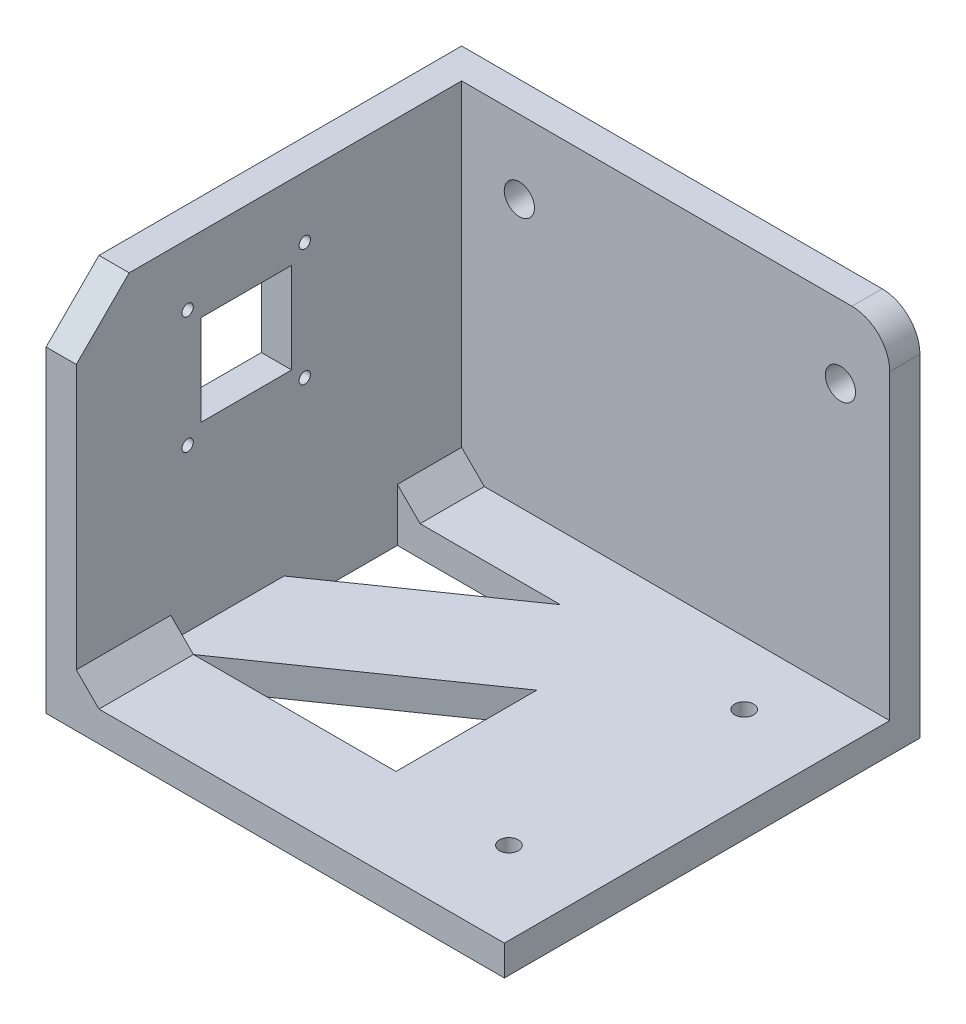
ISO-10303-21;
HEADER;
FILE_DESCRIPTION(('STEP AP214'),'2;1');
FILE_NAME('part.step','',(''),(''),'','','');
FILE_SCHEMA(('AUTOMOTIVE_DESIGN { 1 0 10303 214 1 1 1 1 }'));
ENDSEC;
DATA;
#1=APPLICATION_CONTEXT('core data for automotive mechanical design processes');
#2=APPLICATION_PROTOCOL_DEFINITION('international standard','automotive_design',2000,#1);
#3=PRODUCT_CONTEXT('',#1,'mechanical');
#4=PRODUCT('Part','Part','',(#3));
#5=PRODUCT_RELATED_PRODUCT_CATEGORY('part','',(#4));
#6=PRODUCT_DEFINITION_FORMATION('','',#4);
#7=PRODUCT_DEFINITION_CONTEXT('part definition',#1,'design');
#8=PRODUCT_DEFINITION('design','',#6,#7);
#9=PRODUCT_DEFINITION_SHAPE('','',#8);
#10=(LENGTH_UNIT() NAMED_UNIT(*) SI_UNIT(.MILLI.,.METRE.));
#11=(NAMED_UNIT(*) PLANE_ANGLE_UNIT() SI_UNIT($,.RADIAN.));
#12=(NAMED_UNIT(*) SI_UNIT($,.STERADIAN.) SOLID_ANGLE_UNIT());
#13=UNCERTAINTY_MEASURE_WITH_UNIT(LENGTH_MEASURE(1.E-05),#10,'distance_accuracy_value','');
#14=(GEOMETRIC_REPRESENTATION_CONTEXT(3) GLOBAL_UNCERTAINTY_ASSIGNED_CONTEXT((#13)) GLOBAL_UNIT_ASSIGNED_CONTEXT((#10,
#11,#12)) REPRESENTATION_CONTEXT('',''));
#15=CARTESIAN_POINT('',(0.,0.,0.));
#16=DIRECTION('',(0.,0.,1.));
#17=DIRECTION('',(1.,0.,0.));
#18=AXIS2_PLACEMENT_3D('',#15,#16,#17);
#19=CARTESIAN_POINT('',(92.6460575065019,47.983252299869,5.28762714402703));
#20=DIRECTION('',(0.,0.,-1.));
#21=DIRECTION('',(0.,1.,0.));
#22=AXIS2_PLACEMENT_3D('',#19,#20,#21);
#23=CYLINDRICAL_SURFACE('',#22,10.);
#24=DIRECTION('',(0.,0.,1.));
#25=VECTOR('',#24,1.);
#26=CARTESIAN_POINT('',(102.646057506502,47.983252299869,5.28762714402703));
#27=LINE('',#26,#25);
#28=CARTESIAN_POINT('',(102.646057506502,47.983252299869,-59.7123728559729));
#29=VERTEX_POINT('',#28);
#30=CARTESIAN_POINT('',(102.646057506502,47.983252299869,-51.712372855973));
#31=VERTEX_POINT('',#30);
#32=EDGE_CURVE('E337',#29,#31,#27,.T.);
#33=ORIENTED_EDGE('',*,*,#32,.F.);
#34=CARTESIAN_POINT('',(92.6460575065019,47.983252299869,-59.7123728559728));
#35=DIRECTION('',(0.,0.,1.));
#36=DIRECTION('',(0.,-1.,0.));
#37=AXIS2_PLACEMENT_3D('',#34,#35,#36);
#38=CIRCLE('',#37,10.);
#39=CARTESIAN_POINT('',(92.6460575065019,57.983252299869,-59.712372855973));
#40=VERTEX_POINT('',#39);
#41=EDGE_CURVE('E46',#40,#29,#38,.F.);
#42=ORIENTED_EDGE('',*,*,#41,.F.);
#43=DIRECTION('',(0.,0.,1.));
#44=VECTOR('',#43,1.);
#45=CARTESIAN_POINT('',(92.6460575065019,57.983252299869,5.28762714402703));
#46=LINE('',#45,#44);
#47=CARTESIAN_POINT('',(92.6460575065019,57.983252299869,-51.712372855973));
#48=VERTEX_POINT('',#47);
#49=EDGE_CURVE('E356',#48,#40,#46,.F.);
#50=ORIENTED_EDGE('',*,*,#49,.F.);
#51=CARTESIAN_POINT('',(92.6460575065019,47.983252299869,-51.712372855973));
#52=DIRECTION('',(0.,0.,1.));
#53=DIRECTION('',(1.,0.,0.));
#54=AXIS2_PLACEMENT_3D('',#51,#52,#53);
#55=CIRCLE('',#54,10.);
#56=EDGE_CURVE('E11',#31,#48,#55,.T.);
#57=ORIENTED_EDGE('',*,*,#56,.F.);
#58=EDGE_LOOP('',(#33,#42,#50,#57));
#59=FACE_BOUND('',#58,.T.);
#60=ADVANCED_FACE('F39',(#59),#23,.T.);
#61=CARTESIAN_POINT('',(-10.6622105369335,12.983252299869,5.28762714402702));
#62=DIRECTION('',(-1.,0.,0.));
#63=DIRECTION('',(0.,0.,1.));
#64=AXIS2_PLACEMENT_3D('',#61,#62,#63);
#65=PLANE('',#64);
#66=CARTESIAN_POINT('',(-10.6622105369335,10.7132522998699,20.8125171082051));
#67=DIRECTION('',(1.,0.,0.));
#68=DIRECTION('',(0.,0.,-1.));
#69=AXIS2_PLACEMENT_3D('',#66,#67,#68);
#70=CIRCLE('',#69,1.5);
#71=CARTESIAN_POINT('',(-10.6622105369335,10.7132522998699,19.3125171082051));
#72=VERTEX_POINT('',#71);
#73=EDGE_CURVE('E290',#72,#72,#70,.T.);
#74=ORIENTED_EDGE('',*,*,#73,.F.);
#75=EDGE_LOOP('',(#74));
#76=FACE_BOUND('',#75,.T.);
#77=CARTESIAN_POINT('',(-10.6622105369335,10.7132522998699,-10.1874828917949));
#78=DIRECTION('',(1.,0.,0.));
#79=DIRECTION('',(0.,0.,-1.));
#80=AXIS2_PLACEMENT_3D('',#77,#78,#79);
#81=CIRCLE('',#80,1.5);
#82=CARTESIAN_POINT('',(-10.6622105369335,10.7132522998699,-11.6874828917949));
#83=VERTEX_POINT('',#82);
#84=EDGE_CURVE('E287',#83,#83,#81,.T.);
#85=ORIENTED_EDGE('',*,*,#84,.F.);
#86=EDGE_LOOP('',(#85));
#87=FACE_BOUND('',#86,.T.);
#88=CARTESIAN_POINT('',(-10.6622105369335,41.7132522998699,-10.1874828917949));
#89=DIRECTION('',(1.,0.,0.));
#90=DIRECTION('',(0.,0.,-1.));
#91=AXIS2_PLACEMENT_3D('',#88,#89,#90);
#92=CIRCLE('',#91,1.5);
#93=CARTESIAN_POINT('',(-10.6622105369335,41.7132522998699,-11.6874828917949));
#94=VERTEX_POINT('',#93);
#95=EDGE_CURVE('E291',#94,#94,#92,.T.);
#96=ORIENTED_EDGE('',*,*,#95,.F.);
#97=EDGE_LOOP('',(#96));
#98=FACE_BOUND('',#97,.T.);
#99=CARTESIAN_POINT('',(-10.6622105369335,41.7132522998699,20.8125171082051));
#100=DIRECTION('',(1.,0.,0.));
#101=DIRECTION('',(0.,0.,-1.));
#102=AXIS2_PLACEMENT_3D('',#99,#100,#101);
#103=CIRCLE('',#102,1.5);
#104=CARTESIAN_POINT('',(-10.6622105369335,41.7132522998699,19.3125171082051));
#105=VERTEX_POINT('',#104);
#106=EDGE_CURVE('E280',#105,#105,#103,.T.);
#107=ORIENTED_EDGE('',*,*,#106,.F.);
#108=EDGE_LOOP('',(#107));
#109=FACE_BOUND('',#108,.T.);
#110=DIRECTION('',(0.,0.,-1.));
#111=VECTOR('',#110,1.);
#112=CARTESIAN_POINT('',(-10.6622105369335,14.213252299869,-6.71554840382064));
#113=LINE('',#112,#111);
#114=CARTESIAN_POINT('',(-10.6622105369335,14.213252299869,17.2844515961794));
#115=VERTEX_POINT('',#114);
#116=CARTESIAN_POINT('',(-10.6622105369335,14.213252299869,-6.71554840382064));
#117=VERTEX_POINT('',#116);
#118=EDGE_CURVE('E268',#115,#117,#113,.T.);
#119=ORIENTED_EDGE('',*,*,#118,.F.);
#120=DIRECTION('',(0.,-1.,0.));
#121=VECTOR('',#120,1.);
#122=CARTESIAN_POINT('',(-10.6622105369335,38.213252299869,17.2844515961794));
#123=LINE('',#122,#121);
#124=CARTESIAN_POINT('',(-10.6622105369335,38.213252299869,17.2844515961794));
#125=VERTEX_POINT('',#124);
#126=EDGE_CURVE('E266',#125,#115,#123,.T.);
#127=ORIENTED_EDGE('',*,*,#126,.F.);
#128=DIRECTION('',(0.,0.,1.));
#129=VECTOR('',#128,1.);
#130=CARTESIAN_POINT('',(-10.6622105369335,38.213252299869,-6.71554840382064));
#131=LINE('',#130,#129);
#132=CARTESIAN_POINT('',(-10.6622105369335,38.213252299869,-6.71554840382064));
#133=VERTEX_POINT('',#132);
#134=EDGE_CURVE('E274',#133,#125,#131,.T.);
#135=ORIENTED_EDGE('',*,*,#134,.F.);
#136=DIRECTION('',(0.,1.,0.));
#137=VECTOR('',#136,1.);
#138=CARTESIAN_POINT('',(-10.6622105369335,38.213252299869,-6.71554840382064));
#139=LINE('',#138,#137);
#140=EDGE_CURVE('E271',#117,#133,#139,.T.);
#141=ORIENTED_EDGE('',*,*,#140,.F.);
#142=EDGE_LOOP('',(#119,#127,#135,#141));
#143=FACE_BOUND('',#142,.T.);
#144=DIRECTION('',(0.,0.,1.));
#145=VECTOR('',#144,1.);
#146=CARTESIAN_POINT('',(-10.6622105369335,-26.016747700131,-59.712372855973));
#147=LINE('',#146,#145);
#148=CARTESIAN_POINT('',(-10.6622105369335,-26.016747700131,-51.712372855973));
#149=VERTEX_POINT('',#148);
#150=CARTESIAN_POINT('',(-10.6622105369335,-26.016747700131,-34.712372855973));
#151=VERTEX_POINT('',#150);
#152=EDGE_CURVE('E223',#149,#151,#147,.T.);
#153=ORIENTED_EDGE('',*,*,#152,.F.);
#154=DIRECTION('',(0.,1.,0.));
#155=VECTOR('',#154,1.);
#156=CARTESIAN_POINT('',(-10.6622105369335,12.983252299869,-51.712372855973));
#157=LINE('',#156,#155);
#158=CARTESIAN_POINT('',(-10.6622105369335,57.983252299869,-51.712372855973));
#159=VERTEX_POINT('',#158);
#160=EDGE_CURVE('E419',#149,#159,#157,.T.);
#161=ORIENTED_EDGE('',*,*,#160,.T.);
#162=DIRECTION('',(0.,0.,1.));
#163=VECTOR('',#162,1.);
#164=CARTESIAN_POINT('',(-10.6622105369335,57.983252299869,-39.712372855973));
#165=LINE('',#164,#163);
#166=CARTESIAN_POINT('',(-10.6622105369335,57.983252299869,36.287627144027));
#167=VERTEX_POINT('',#166);
#168=EDGE_CURVE('E302',#159,#167,#165,.T.);
#169=ORIENTED_EDGE('',*,*,#168,.T.);
#170=DIRECTION('',(0.,0.707106781186547,-0.707106781186547));
#171=VECTOR('',#170,1.);
#172=CARTESIAN_POINT('',(-10.6622105369335,43.983252299869,50.287627144027));
#173=LINE('',#172,#171);
#174=CARTESIAN_POINT('',(-10.6622105369335,43.983252299869,50.287627144027));
#175=VERTEX_POINT('',#174);
#176=EDGE_CURVE('E225',#175,#167,#173,.T.);
#177=ORIENTED_EDGE('',*,*,#176,.F.);
#178=DIRECTION('',(0.,-1.,0.));
#179=VECTOR('',#178,1.);
#180=CARTESIAN_POINT('',(-10.6622105369335,57.983252299869,50.287627144027));
#181=LINE('',#180,#179);
#182=CARTESIAN_POINT('',(-10.6622105369335,-26.016747700131,50.287627144027));
#183=VERTEX_POINT('',#182);
#184=EDGE_CURVE('E299',#175,#183,#181,.T.);
#185=ORIENTED_EDGE('',*,*,#184,.T.);
#186=CARTESIAN_POINT('',(-10.6622105369335,-26.016747700131,25.287627144027));
#187=VERTEX_POINT('',#186);
#188=EDGE_CURVE('E226',#187,#183,#147,.T.);
#189=ORIENTED_EDGE('',*,*,#188,.F.);
#190=DIRECTION('',(0.,-1.,0.));
#191=VECTOR('',#190,1.);
#192=CARTESIAN_POINT('',(-10.6622105369335,57.983252299869,25.287627144027));
#193=LINE('',#192,#191);
#194=CARTESIAN_POINT('',(-10.6622105369335,-32.016747700131,25.287627144027));
#195=VERTEX_POINT('',#194);
#196=EDGE_CURVE('E199',#187,#195,#193,.T.);
#197=ORIENTED_EDGE('',*,*,#196,.T.);
#198=DIRECTION('',(0.,0.,1.));
#199=VECTOR('',#198,1.);
#200=CARTESIAN_POINT('',(-10.6622105369335,-32.016747700131,-4.712372855973));
#201=LINE('',#200,#199);
#202=CARTESIAN_POINT('',(-10.6622105369335,-32.016747700131,-4.712372855973));
#203=VERTEX_POINT('',#202);
#204=EDGE_CURVE('E397',#203,#195,#201,.T.);
#205=ORIENTED_EDGE('',*,*,#204,.F.);
#206=DIRECTION('',(0.,-1.,0.));
#207=VECTOR('',#206,1.);
#208=CARTESIAN_POINT('',(-10.6622105369335,-32.016747700131,-4.712372855973));
#209=LINE('',#208,#207);
#210=CARTESIAN_POINT('',(-10.6622105369335,-40.016747700131,-4.71237285597299));
#211=VERTEX_POINT('',#210);
#212=EDGE_CURVE('E409',#203,#211,#209,.T.);
#213=ORIENTED_EDGE('',*,*,#212,.T.);
#214=DIRECTION('',(0.,0.,-1.));
#215=VECTOR('',#214,1.);
#216=CARTESIAN_POINT('',(-10.6622105369335,-40.016747700131,-34.712372855973));
#217=LINE('',#216,#215);
#218=CARTESIAN_POINT('',(-10.6622105369335,-40.016747700131,-34.712372855973));
#219=VERTEX_POINT('',#218);
#220=EDGE_CURVE('E427',#211,#219,#217,.T.);
#221=ORIENTED_EDGE('',*,*,#220,.T.);
#222=DIRECTION('',(0.,-1.,0.));
#223=VECTOR('',#222,1.);
#224=CARTESIAN_POINT('',(-10.6622105369335,57.983252299869,-34.712372855973));
#225=LINE('',#224,#223);
#226=EDGE_CURVE('E200',#151,#219,#225,.T.);
#227=ORIENTED_EDGE('',*,*,#226,.F.);
#228=EDGE_LOOP('',(#153,#161,#169,#177,#185,#189,#197,#205,#213,#221,#227));
#229=FACE_BOUND('',#228,.T.);
#230=ADVANCED_FACE('F384',(#76,#87,#98,#109,#143,#229),#65,.F.);
#231=CARTESIAN_POINT('',(48.9521140423729,57.983252299869,-34.712372855973));
#232=DIRECTION('',(1.,0.,0.));
#233=DIRECTION('',(0.,0.,-1.));
#234=AXIS2_PLACEMENT_3D('',#231,#232,#233);
#235=PLANE('',#234);
#236=DIRECTION('',(0.,-1.,0.));
#237=VECTOR('',#236,1.);
#238=CARTESIAN_POINT('',(48.9521140423729,-32.016747700131,-11.9915943580509));
#239=LINE('',#238,#237);
#240=CARTESIAN_POINT('',(48.9521140423729,-32.016747700131,-11.9915943580509));
#241=VERTEX_POINT('',#240);
#242=CARTESIAN_POINT('',(48.9521140423729,-40.016747700131,-11.9915943580509));
#243=VERTEX_POINT('',#242);
#244=EDGE_CURVE('E186',#241,#243,#239,.T.);
#245=ORIENTED_EDGE('',*,*,#244,.T.);
#246=DIRECTION('',(0.,0.,1.));
#247=VECTOR('',#246,1.);
#248=CARTESIAN_POINT('',(48.9521140423729,-40.016747700131,-34.712372855973));
#249=LINE('',#248,#247);
#250=CARTESIAN_POINT('',(48.9521140423729,-40.016747700131,25.287627144027));
#251=VERTEX_POINT('',#250);
#252=EDGE_CURVE('E181',#243,#251,#249,.T.);
#253=ORIENTED_EDGE('',*,*,#252,.T.);
#254=DIRECTION('',(0.,-1.,0.));
#255=VECTOR('',#254,1.);
#256=CARTESIAN_POINT('',(48.9521140423729,57.983252299869,25.287627144027));
#257=LINE('',#256,#255);
#258=CARTESIAN_POINT('',(48.9521140423729,-32.016747700131,25.287627144027));
#259=VERTEX_POINT('',#258);
#260=EDGE_CURVE('E184',#259,#251,#257,.T.);
#261=ORIENTED_EDGE('',*,*,#260,.F.);
#262=DIRECTION('',(0.,0.,1.));
#263=VECTOR('',#262,1.);
#264=CARTESIAN_POINT('',(48.9521140423729,-32.016747700131,50.287627144027));
#265=LINE('',#264,#263);
#266=EDGE_CURVE('E217',#241,#259,#265,.T.);
#267=ORIENTED_EDGE('',*,*,#266,.F.);
#268=EDGE_LOOP('',(#245,#253,#261,#267));
#269=FACE_BOUND('',#268,.T.);
#270=ADVANCED_FACE('F183',(#269),#235,.F.);
#271=CARTESIAN_POINT('',(-10.6622105369335,57.983252299869,25.287627144027));
#272=DIRECTION('',(0.,0.,1.));
#273=DIRECTION('',(1.,0.,0.));
#274=AXIS2_PLACEMENT_3D('',#271,#272,#273);
#275=PLANE('',#274);
#276=DIRECTION('',(0.,-1.,0.));
#277=VECTOR('',#276,1.);
#278=CARTESIAN_POINT('',(-4.66221053693349,-32.016747700131,25.287627144027));
#279=LINE('',#278,#277);
#280=CARTESIAN_POINT('',(-4.66221053693349,-32.016747700131,25.287627144027));
#281=VERTEX_POINT('',#280);
#282=CARTESIAN_POINT('',(-4.66221053693349,-40.016747700131,25.287627144027));
#283=VERTEX_POINT('',#282);
#284=EDGE_CURVE('E425',#281,#283,#279,.T.);
#285=ORIENTED_EDGE('',*,*,#284,.F.);
#286=DIRECTION('',(-1.,0.,0.));
#287=VECTOR('',#286,1.);
#288=CARTESIAN_POINT('',(102.646057506502,-32.016747700131,25.287627144027));
#289=LINE('',#288,#287);
#290=EDGE_CURVE('E198',#259,#281,#289,.T.);
#291=ORIENTED_EDGE('',*,*,#290,.F.);
#292=ORIENTED_EDGE('',*,*,#260,.T.);
#293=DIRECTION('',(-1.,0.,0.));
#294=VECTOR('',#293,1.);
#295=CARTESIAN_POINT('',(-10.6622105369335,-40.016747700131,25.287627144027));
#296=LINE('',#295,#294);
#297=EDGE_CURVE('E191',#251,#283,#296,.T.);
#298=ORIENTED_EDGE('',*,*,#297,.T.);
#299=EDGE_LOOP('',(#285,#291,#292,#298));
#300=FACE_BOUND('',#299,.T.);
#301=ADVANCED_FACE('F196',(#300),#275,.F.);
#302=CARTESIAN_POINT('',(-10.6622105369335,57.983252299869,-34.712372855973));
#303=DIRECTION('',(0.,0.,-1.));
#304=DIRECTION('',(-1.,0.,0.));
#305=AXIS2_PLACEMENT_3D('',#302,#303,#304);
#306=PLANE('',#305);
#307=DIRECTION('',(0.,-1.,0.));
#308=VECTOR('',#307,1.);
#309=CARTESIAN_POINT('',(32.4832649470313,-32.016747700131,-34.712372855973));
#310=LINE('',#309,#308);
#311=CARTESIAN_POINT('',(32.4832649470313,-32.016747700131,-34.712372855973));
#312=VERTEX_POINT('',#311);
#313=CARTESIAN_POINT('',(32.4832649470313,-40.016747700131,-34.712372855973));
#314=VERTEX_POINT('',#313);
#315=EDGE_CURVE('E411',#312,#314,#310,.T.);
#316=ORIENTED_EDGE('',*,*,#315,.F.);
#317=DIRECTION('',(1.,0.,0.));
#318=VECTOR('',#317,1.);
#319=CARTESIAN_POINT('',(102.646057506502,-32.016747700131,-34.712372855973));
#320=LINE('',#319,#318);
#321=CARTESIAN_POINT('',(-4.66221053693349,-32.016747700131,-34.712372855973));
#322=VERTEX_POINT('',#321);
#323=EDGE_CURVE('E212',#322,#312,#320,.T.);
#324=ORIENTED_EDGE('',*,*,#323,.F.);
#325=DIRECTION('',(-0.707106781186547,0.707106781186548,0.));
#326=VECTOR('',#325,1.);
#327=CARTESIAN_POINT('',(-10.6622105369335,-26.016747700131,-34.712372855973));
#328=LINE('',#327,#326);
#329=EDGE_CURVE('E328',#322,#151,#328,.T.);
#330=ORIENTED_EDGE('',*,*,#329,.T.);
#331=ORIENTED_EDGE('',*,*,#226,.T.);
#332=DIRECTION('',(1.,0.,0.));
#333=VECTOR('',#332,1.);
#334=CARTESIAN_POINT('',(-10.6622105369335,-40.016747700131,-34.712372855973));
#335=LINE('',#334,#333);
#336=EDGE_CURVE('E192',#219,#314,#335,.T.);
#337=ORIENTED_EDGE('',*,*,#336,.T.);
#338=EDGE_LOOP('',(#316,#324,#330,#331,#337));
#339=FACE_BOUND('',#338,.T.);
#340=ADVANCED_FACE('F430',(#339),#306,.F.);
#341=CARTESIAN_POINT('',(-10.6622105369335,-26.016747700131,-59.712372855973));
#342=DIRECTION('',(0.707106781186548,0.707106781186547,0.));
#343=DIRECTION('',(-0.707106781186547,0.707106781186548,0.));
#344=AXIS2_PLACEMENT_3D('',#341,#342,#343);
#345=PLANE('',#344);
#346=DIRECTION('',(0.707106781186547,-0.707106781186548,0.));
#347=VECTOR('',#346,1.);
#348=CARTESIAN_POINT('',(-10.6622105369335,-26.016747700131,25.287627144027));
#349=LINE('',#348,#347);
#350=EDGE_CURVE('E331',#187,#281,#349,.T.);
#351=ORIENTED_EDGE('',*,*,#350,.F.);
#352=ORIENTED_EDGE('',*,*,#188,.T.);
#353=DIRECTION('',(-0.707106781186547,0.707106781186548,0.));
#354=VECTOR('',#353,1.);
#355=CARTESIAN_POINT('',(-10.6622105369335,-26.016747700131,50.287627144027));
#356=LINE('',#355,#354);
#357=CARTESIAN_POINT('',(-4.66221053693349,-32.016747700131,50.287627144027));
#358=VERTEX_POINT('',#357);
#359=EDGE_CURVE('E219',#358,#183,#356,.T.);
#360=ORIENTED_EDGE('',*,*,#359,.F.);
#361=DIRECTION('',(0.,0.,1.));
#362=VECTOR('',#361,1.);
#363=CARTESIAN_POINT('',(-4.66221053693349,-32.016747700131,-59.712372855973));
#364=LINE('',#363,#362);
#365=EDGE_CURVE('E222',#281,#358,#364,.T.);
#366=ORIENTED_EDGE('',*,*,#365,.F.);
#367=EDGE_LOOP('',(#351,#352,#360,#366));
#368=FACE_BOUND('',#367,.T.);
#369=ADVANCED_FACE('F394',(#368),#345,.T.);
#370=CARTESIAN_POINT('',(102.646057506502,-32.016747700131,50.287627144027));
#371=DIRECTION('',(0.,-1.,0.));
#372=DIRECTION('',(0.,0.,-1.));
#373=AXIS2_PLACEMENT_3D('',#370,#371,#372);
#374=PLANE('',#373);
#375=CARTESIAN_POINT('',(80.8237614787084,-32.016747700131,-35.0168591290556));
#376=DIRECTION('',(0.,1.,0.));
#377=DIRECTION('',(0.,0.,1.));
#378=AXIS2_PLACEMENT_3D('',#375,#376,#377);
#379=CIRCLE('',#378,2.5);
#380=CARTESIAN_POINT('',(80.8237614787084,-32.016747700131,-32.5168591290556));
#381=VERTEX_POINT('',#380);
#382=EDGE_CURVE('E346',#381,#381,#379,.T.);
#383=ORIENTED_EDGE('',*,*,#382,.F.);
#384=EDGE_LOOP('',(#383));
#385=FACE_BOUND('',#384,.T.);
#386=CARTESIAN_POINT('',(80.8237614787084,-32.016747700131,27.2596519715804));
#387=DIRECTION('',(0.,1.,0.));
#388=DIRECTION('',(0.,0.,1.));
#389=AXIS2_PLACEMENT_3D('',#386,#387,#388);
#390=CIRCLE('',#389,2.5);
#391=CARTESIAN_POINT('',(80.8237614787084,-32.016747700131,29.7596519715804));
#392=VERTEX_POINT('',#391);
#393=EDGE_CURVE('E342',#392,#392,#390,.T.);
#394=ORIENTED_EDGE('',*,*,#393,.F.);
#395=EDGE_LOOP('',(#394));
#396=FACE_BOUND('',#395,.T.);
#397=DIRECTION('',(0.,0.,1.));
#398=VECTOR('',#397,1.);
#399=CARTESIAN_POINT('',(102.646057506502,-32.016747700131,50.287627144027));
#400=LINE('',#399,#398);
#401=CARTESIAN_POINT('',(102.646057506502,-32.016747700131,-51.712372855973));
#402=VERTEX_POINT('',#401);
#403=CARTESIAN_POINT('',(102.646057506502,-32.016747700131,50.287627144027));
#404=VERTEX_POINT('',#403);
#405=EDGE_CURVE('E252',#402,#404,#400,.T.);
#406=ORIENTED_EDGE('',*,*,#405,.F.);
#407=DIRECTION('',(-1.,0.,0.));
#408=VECTOR('',#407,1.);
#409=CARTESIAN_POINT('',(102.646057506502,-32.016747700131,-51.712372855973));
#410=LINE('',#409,#408);
#411=CARTESIAN_POINT('',(-4.66221053693349,-32.016747700131,-51.712372855973));
#412=VERTEX_POINT('',#411);
#413=EDGE_CURVE('E443',#402,#412,#410,.T.);
#414=ORIENTED_EDGE('',*,*,#413,.T.);
#415=EDGE_CURVE('E227',#412,#322,#364,.T.);
#416=ORIENTED_EDGE('',*,*,#415,.T.);
#417=ORIENTED_EDGE('',*,*,#323,.T.);
#418=DIRECTION('',(-0.821032247487943,0.,0.570881816652884));
#419=VECTOR('',#418,1.);
#420=CARTESIAN_POINT('',(32.4832649470313,-32.016747700131,-34.712372855973));
#421=LINE('',#420,#419);
#422=EDGE_CURVE('E407',#312,#203,#421,.T.);
#423=ORIENTED_EDGE('',*,*,#422,.T.);
#424=ORIENTED_EDGE('',*,*,#204,.T.);
#425=DIRECTION('',(1.,0.,0.));
#426=VECTOR('',#425,1.);
#427=CARTESIAN_POINT('',(-10.6622105369335,-32.016747700131,25.287627144027));
#428=LINE('',#427,#426);
#429=EDGE_CURVE('E405',#195,#281,#428,.T.);
#430=ORIENTED_EDGE('',*,*,#429,.T.);
#431=DIRECTION('',(0.821032247487943,0.,-0.570881816652884));
#432=VECTOR('',#431,1.);
#433=CARTESIAN_POINT('',(-4.66221053693349,-32.016747700131,25.287627144027));
#434=LINE('',#433,#432);
#435=EDGE_CURVE('E413',#281,#241,#434,.T.);
#436=ORIENTED_EDGE('',*,*,#435,.T.);
#437=ORIENTED_EDGE('',*,*,#266,.T.);
#438=ORIENTED_EDGE('',*,*,#290,.T.);
#439=ORIENTED_EDGE('',*,*,#365,.T.);
#440=DIRECTION('',(-1.,0.,0.));
#441=VECTOR('',#440,1.);
#442=CARTESIAN_POINT('',(102.646057506502,-32.016747700131,50.287627144027));
#443=LINE('',#442,#441);
#444=EDGE_CURVE('E254',#404,#358,#443,.T.);
#445=ORIENTED_EDGE('',*,*,#444,.F.);
#446=EDGE_LOOP('',(#406,#414,#416,#417,#423,#424,#430,#436,#437,#438,#439,#445));
#447=FACE_BOUND('',#446,.T.);
#448=ADVANCED_FACE('F403',(#385,#396,#447),#374,.F.);
#449=CARTESIAN_POINT('',(-10.6622105369335,57.983252299869,-39.712372855973));
#450=DIRECTION('',(0.,-1.,0.));
#451=DIRECTION('',(0.,0.,-1.));
#452=AXIS2_PLACEMENT_3D('',#449,#450,#451);
#453=PLANE('',#452);
#454=DIRECTION('',(-1.,0.,0.));
#455=VECTOR('',#454,1.);
#456=CARTESIAN_POINT('',(-18.6622105369335,57.983252299869,-51.712372855973));
#457=LINE('',#456,#455);
#458=EDGE_CURVE('E341',#48,#159,#457,.T.);
#459=ORIENTED_EDGE('',*,*,#458,.F.);
#460=ORIENTED_EDGE('',*,*,#49,.T.);
#461=DIRECTION('',(1.,0.,0.));
#462=VECTOR('',#461,1.);
#463=CARTESIAN_POINT('',(-18.6622105369335,57.983252299869,-59.712372855973));
#464=LINE('',#463,#462);
#465=CARTESIAN_POINT('',(-18.6622105369335,57.983252299869,-59.712372855973));
#466=VERTEX_POINT('',#465);
#467=EDGE_CURVE('E237',#466,#40,#464,.T.);
#468=ORIENTED_EDGE('',*,*,#467,.F.);
#469=DIRECTION('',(0.,0.,1.));
#470=VECTOR('',#469,1.);
#471=CARTESIAN_POINT('',(-18.6622105369335,57.983252299869,-39.712372855973));
#472=LINE('',#471,#470);
#473=CARTESIAN_POINT('',(-18.6622105369335,57.983252299869,36.287627144027));
#474=VERTEX_POINT('',#473);
#475=EDGE_CURVE('E303',#466,#474,#472,.T.);
#476=ORIENTED_EDGE('',*,*,#475,.T.);
#477=DIRECTION('',(1.,0.,0.));
#478=VECTOR('',#477,1.);
#479=CARTESIAN_POINT('',(-18.6622105369335,57.983252299869,36.287627144027));
#480=LINE('',#479,#478);
#481=EDGE_CURVE('E232',#474,#167,#480,.T.);
#482=ORIENTED_EDGE('',*,*,#481,.T.);
#483=ORIENTED_EDGE('',*,*,#168,.F.);
#484=EDGE_LOOP('',(#459,#460,#468,#476,#482,#483));
#485=FACE_BOUND('',#484,.T.);
#486=ADVANCED_FACE('F375',(#485),#453,.F.);
#487=CARTESIAN_POINT('',(-10.6622105369335,57.983252299869,50.287627144027));
#488=DIRECTION('',(0.,0.,-1.));
#489=DIRECTION('',(0.,1.,0.));
#490=AXIS2_PLACEMENT_3D('',#487,#488,#489);
#491=PLANE('',#490);
#492=ORIENTED_EDGE('',*,*,#444,.T.);
#493=ORIENTED_EDGE('',*,*,#359,.T.);
#494=ORIENTED_EDGE('',*,*,#184,.F.);
#495=DIRECTION('',(1.,0.,0.));
#496=VECTOR('',#495,1.);
#497=CARTESIAN_POINT('',(-18.6622105369335,43.983252299869,50.287627144027));
#498=LINE('',#497,#496);
#499=CARTESIAN_POINT('',(-18.6622105369335,43.983252299869,50.287627144027));
#500=VERTEX_POINT('',#499);
#501=EDGE_CURVE('E235',#500,#175,#498,.T.);
#502=ORIENTED_EDGE('',*,*,#501,.F.);
#503=DIRECTION('',(0.,-1.,0.));
#504=VECTOR('',#503,1.);
#505=CARTESIAN_POINT('',(-18.6622105369335,57.983252299869,50.287627144027));
#506=LINE('',#505,#504);
#507=CARTESIAN_POINT('',(-18.6622105369335,-40.016747700131,50.287627144027));
#508=VERTEX_POINT('',#507);
#509=EDGE_CURVE('E306',#500,#508,#506,.T.);
#510=ORIENTED_EDGE('',*,*,#509,.T.);
#511=DIRECTION('',(-1.,0.,0.));
#512=VECTOR('',#511,1.);
#513=CARTESIAN_POINT('',(102.646057506502,-40.016747700131,50.287627144027));
#514=LINE('',#513,#512);
#515=CARTESIAN_POINT('',(102.646057506502,-40.016747700131,50.287627144027));
#516=VERTEX_POINT('',#515);
#517=EDGE_CURVE('E263',#516,#508,#514,.T.);
#518=ORIENTED_EDGE('',*,*,#517,.F.);
#519=DIRECTION('',(0.,-1.,0.));
#520=VECTOR('',#519,1.);
#521=CARTESIAN_POINT('',(102.646057506502,-32.016747700131,50.287627144027));
#522=LINE('',#521,#520);
#523=EDGE_CURVE('E243',#404,#516,#522,.T.);
#524=ORIENTED_EDGE('',*,*,#523,.F.);
#525=EDGE_LOOP('',(#492,#493,#494,#502,#510,#518,#524));
#526=FACE_BOUND('',#525,.T.);
#527=ADVANCED_FACE('F388',(#526),#491,.F.);
#528=CARTESIAN_POINT('',(-18.6622105369335,12.983252299869,5.28762714402702));
#529=DIRECTION('',(-1.,0.,0.));
#530=DIRECTION('',(0.,0.,1.));
#531=AXIS2_PLACEMENT_3D('',#528,#529,#530);
#532=PLANE('',#531);
#533=DIRECTION('',(0.,0.707106781186547,-0.707106781186547));
#534=VECTOR('',#533,1.);
#535=CARTESIAN_POINT('',(-18.6622105369335,43.983252299869,50.287627144027));
#536=LINE('',#535,#534);
#537=EDGE_CURVE('E229',#500,#474,#536,.T.);
#538=ORIENTED_EDGE('',*,*,#537,.T.);
#539=ORIENTED_EDGE('',*,*,#475,.F.);
#540=DIRECTION('',(0.,1.,0.));
#541=VECTOR('',#540,1.);
#542=CARTESIAN_POINT('',(-18.6622105369335,-32.016747700131,-59.712372855973));
#543=LINE('',#542,#541);
#544=CARTESIAN_POINT('',(-18.6622105369335,-40.016747700131,-59.712372855973));
#545=VERTEX_POINT('',#544);
#546=EDGE_CURVE('E247',#545,#466,#543,.T.);
#547=ORIENTED_EDGE('',*,*,#546,.F.);
#548=DIRECTION('',(0.,0.,-1.));
#549=VECTOR('',#548,1.);
#550=CARTESIAN_POINT('',(-18.6622105369335,-40.016747700131,50.287627144027));
#551=LINE('',#550,#549);
#552=EDGE_CURVE('E242',#508,#545,#551,.T.);
#553=ORIENTED_EDGE('',*,*,#552,.F.);
#554=ORIENTED_EDGE('',*,*,#509,.F.);
#555=EDGE_LOOP('',(#538,#539,#547,#553,#554));
#556=FACE_BOUND('',#555,.T.);
#557=DIRECTION('',(0.,1.,0.));
#558=VECTOR('',#557,1.);
#559=CARTESIAN_POINT('',(-18.6622105369335,12.983252299869,17.2844515961794));
#560=LINE('',#559,#558);
#561=CARTESIAN_POINT('',(-18.6622105369335,14.213252299869,17.2844515961794));
#562=VERTEX_POINT('',#561);
#563=CARTESIAN_POINT('',(-18.6622105369335,38.213252299869,17.2844515961794));
#564=VERTEX_POINT('',#563);
#565=EDGE_CURVE('E326',#562,#564,#560,.T.);
#566=ORIENTED_EDGE('',*,*,#565,.F.);
#567=DIRECTION('',(0.,0.,1.));
#568=VECTOR('',#567,1.);
#569=CARTESIAN_POINT('',(-18.6622105369335,14.213252299869,5.28762714402702));
#570=LINE('',#569,#568);
#571=CARTESIAN_POINT('',(-18.6622105369335,14.213252299869,-6.71554840382064));
#572=VERTEX_POINT('',#571);
#573=EDGE_CURVE('E305',#572,#562,#570,.T.);
#574=ORIENTED_EDGE('',*,*,#573,.F.);
#575=DIRECTION('',(0.,-1.,0.));
#576=VECTOR('',#575,1.);
#577=CARTESIAN_POINT('',(-18.6622105369335,12.983252299869,-6.71554840382064));
#578=LINE('',#577,#576);
#579=CARTESIAN_POINT('',(-18.6622105369335,38.213252299869,-6.71554840382064));
#580=VERTEX_POINT('',#579);
#581=EDGE_CURVE('E321',#580,#572,#578,.T.);
#582=ORIENTED_EDGE('',*,*,#581,.F.);
#583=DIRECTION('',(0.,0.,-1.));
#584=VECTOR('',#583,1.);
#585=CARTESIAN_POINT('',(-18.6622105369335,38.213252299869,5.28762714402702));
#586=LINE('',#585,#584);
#587=EDGE_CURVE('E324',#564,#580,#586,.T.);
#588=ORIENTED_EDGE('',*,*,#587,.F.);
#589=EDGE_LOOP('',(#566,#574,#582,#588));
#590=FACE_BOUND('',#589,.T.);
#591=CARTESIAN_POINT('',(-18.6622105369335,41.7132522998699,20.8125171082051));
#592=DIRECTION('',(-1.,0.,0.));
#593=DIRECTION('',(0.,0.,1.));
#594=AXIS2_PLACEMENT_3D('',#591,#592,#593);
#595=CIRCLE('',#594,1.5);
#596=CARTESIAN_POINT('',(-18.6622105369335,41.7132522998699,22.3125171082051));
#597=VERTEX_POINT('',#596);
#598=EDGE_CURVE('E308',#597,#597,#595,.T.);
#599=ORIENTED_EDGE('',*,*,#598,.F.);
#600=EDGE_LOOP('',(#599));
#601=FACE_BOUND('',#600,.T.);
#602=CARTESIAN_POINT('',(-18.6622105369335,41.7132522998699,-10.1874828917949));
#603=DIRECTION('',(-1.,0.,0.));
#604=DIRECTION('',(0.,0.,1.));
#605=AXIS2_PLACEMENT_3D('',#602,#603,#604);
#606=CIRCLE('',#605,1.5);
#607=CARTESIAN_POINT('',(-18.6622105369335,41.7132522998699,-8.68748289179486));
#608=VERTEX_POINT('',#607);
#609=EDGE_CURVE('E315',#608,#608,#606,.T.);
#610=ORIENTED_EDGE('',*,*,#609,.F.);
#611=EDGE_LOOP('',(#610));
#612=FACE_BOUND('',#611,.T.);
#613=CARTESIAN_POINT('',(-18.6622105369335,10.7132522998699,-10.1874828917949));
#614=DIRECTION('',(-1.,0.,0.));
#615=DIRECTION('',(0.,0.,1.));
#616=AXIS2_PLACEMENT_3D('',#613,#614,#615);
#617=CIRCLE('',#616,1.5);
#618=CARTESIAN_POINT('',(-18.6622105369335,10.7132522998699,-8.68748289179486));
#619=VERTEX_POINT('',#618);
#620=EDGE_CURVE('E312',#619,#619,#617,.T.);
#621=ORIENTED_EDGE('',*,*,#620,.F.);
#622=EDGE_LOOP('',(#621));
#623=FACE_BOUND('',#622,.T.);
#624=CARTESIAN_POINT('',(-18.6622105369335,10.7132522998699,20.8125171082051));
#625=DIRECTION('',(-1.,0.,0.));
#626=DIRECTION('',(0.,0.,1.));
#627=AXIS2_PLACEMENT_3D('',#624,#625,#626);
#628=CIRCLE('',#627,1.5);
#629=CARTESIAN_POINT('',(-18.6622105369335,10.7132522998699,22.3125171082051));
#630=VERTEX_POINT('',#629);
#631=EDGE_CURVE('E298',#630,#630,#628,.T.);
#632=ORIENTED_EDGE('',*,*,#631,.F.);
#633=EDGE_LOOP('',(#632));
#634=FACE_BOUND('',#633,.T.);
#635=ADVANCED_FACE('F369',(#556,#590,#601,#612,#623,#634),#532,.T.);
#636=CARTESIAN_POINT('',(-20.6622105369335,10.7132522998699,20.8125171082051));
#637=DIRECTION('',(1.,0.,0.));
#638=DIRECTION('',(0.,0.,-1.));
#639=AXIS2_PLACEMENT_3D('',#636,#637,#638);
#640=CYLINDRICAL_SURFACE('',#639,1.5);
#641=ORIENTED_EDGE('',*,*,#631,.T.);
#642=EDGE_LOOP('',(#641));
#643=FACE_BOUND('',#642,.T.);
#644=ORIENTED_EDGE('',*,*,#73,.T.);
#645=EDGE_LOOP('',(#644));
#646=FACE_BOUND('',#645,.T.);
#647=ADVANCED_FACE('F500',(#643,#646),#640,.F.);
#648=CARTESIAN_POINT('',(-20.6622105369335,10.7132522998699,-10.1874828917949));
#649=DIRECTION('',(1.,0.,0.));
#650=DIRECTION('',(0.,0.,-1.));
#651=AXIS2_PLACEMENT_3D('',#648,#649,#650);
#652=CYLINDRICAL_SURFACE('',#651,1.5);
#653=ORIENTED_EDGE('',*,*,#620,.T.);
#654=EDGE_LOOP('',(#653));
#655=FACE_BOUND('',#654,.T.);
#656=ORIENTED_EDGE('',*,*,#84,.T.);
#657=EDGE_LOOP('',(#656));
#658=FACE_BOUND('',#657,.T.);
#659=ADVANCED_FACE('F522',(#655,#658),#652,.F.);
#660=CARTESIAN_POINT('',(-20.6622105369335,41.7132522998699,-10.1874828917949));
#661=DIRECTION('',(1.,0.,0.));
#662=DIRECTION('',(0.,0.,-1.));
#663=AXIS2_PLACEMENT_3D('',#660,#661,#662);
#664=CYLINDRICAL_SURFACE('',#663,1.5);
#665=ORIENTED_EDGE('',*,*,#609,.T.);
#666=EDGE_LOOP('',(#665));
#667=FACE_BOUND('',#666,.T.);
#668=ORIENTED_EDGE('',*,*,#95,.T.);
#669=EDGE_LOOP('',(#668));
#670=FACE_BOUND('',#669,.T.);
#671=ADVANCED_FACE('F529',(#667,#670),#664,.F.);
#672=CARTESIAN_POINT('',(-20.6622105369335,41.7132522998699,20.8125171082051));
#673=DIRECTION('',(1.,0.,0.));
#674=DIRECTION('',(0.,0.,-1.));
#675=AXIS2_PLACEMENT_3D('',#672,#673,#674);
#676=CYLINDRICAL_SURFACE('',#675,1.5);
#677=ORIENTED_EDGE('',*,*,#598,.T.);
#678=EDGE_LOOP('',(#677));
#679=FACE_BOUND('',#678,.T.);
#680=ORIENTED_EDGE('',*,*,#106,.T.);
#681=EDGE_LOOP('',(#680));
#682=FACE_BOUND('',#681,.T.);
#683=ADVANCED_FACE('F537',(#679,#682),#676,.F.);
#684=CARTESIAN_POINT('',(-20.6622105369335,38.213252299869,17.2844515961794));
#685=DIRECTION('',(0.,0.,1.));
#686=DIRECTION('',(0.,-1.,0.));
#687=AXIS2_PLACEMENT_3D('',#684,#685,#686);
#688=PLANE('',#687);
#689=ORIENTED_EDGE('',*,*,#565,.T.);
#690=DIRECTION('',(1.,0.,0.));
#691=VECTOR('',#690,1.);
#692=CARTESIAN_POINT('',(-20.6622105369335,38.213252299869,17.2844515961794));
#693=LINE('',#692,#691);
#694=EDGE_CURVE('E278',#564,#125,#693,.T.);
#695=ORIENTED_EDGE('',*,*,#694,.T.);
#696=ORIENTED_EDGE('',*,*,#126,.T.);
#697=DIRECTION('',(1.,0.,0.));
#698=VECTOR('',#697,1.);
#699=CARTESIAN_POINT('',(-20.6622105369335,14.213252299869,17.2844515961794));
#700=LINE('',#699,#698);
#701=EDGE_CURVE('E277',#562,#115,#700,.T.);
#702=ORIENTED_EDGE('',*,*,#701,.F.);
#703=EDGE_LOOP('',(#689,#695,#696,#702));
#704=FACE_BOUND('',#703,.T.);
#705=ADVANCED_FACE('F545',(#704),#688,.F.);
#706=CARTESIAN_POINT('',(-20.6622105369335,38.213252299869,-6.71554840382064));
#707=DIRECTION('',(0.,1.,0.));
#708=DIRECTION('',(0.,0.,1.));
#709=AXIS2_PLACEMENT_3D('',#706,#707,#708);
#710=PLANE('',#709);
#711=ORIENTED_EDGE('',*,*,#587,.T.);
#712=DIRECTION('',(1.,0.,0.));
#713=VECTOR('',#712,1.);
#714=CARTESIAN_POINT('',(-20.6622105369335,38.213252299869,-6.71554840382064));
#715=LINE('',#714,#713);
#716=EDGE_CURVE('E281',#580,#133,#715,.T.);
#717=ORIENTED_EDGE('',*,*,#716,.T.);
#718=ORIENTED_EDGE('',*,*,#134,.T.);
#719=ORIENTED_EDGE('',*,*,#694,.F.);
#720=EDGE_LOOP('',(#711,#717,#718,#719));
#721=FACE_BOUND('',#720,.T.);
#722=ADVANCED_FACE('F552',(#721),#710,.F.);
#723=CARTESIAN_POINT('',(-20.6622105369335,38.213252299869,-6.71554840382064));
#724=DIRECTION('',(0.,0.,-1.));
#725=DIRECTION('',(0.,1.,0.));
#726=AXIS2_PLACEMENT_3D('',#723,#724,#725);
#727=PLANE('',#726);
#728=ORIENTED_EDGE('',*,*,#581,.T.);
#729=DIRECTION('',(1.,0.,0.));
#730=VECTOR('',#729,1.);
#731=CARTESIAN_POINT('',(-20.6622105369335,14.213252299869,-6.71554840382064));
#732=LINE('',#731,#730);
#733=EDGE_CURVE('E283',#572,#117,#732,.T.);
#734=ORIENTED_EDGE('',*,*,#733,.T.);
#735=ORIENTED_EDGE('',*,*,#140,.T.);
#736=ORIENTED_EDGE('',*,*,#716,.F.);
#737=EDGE_LOOP('',(#728,#734,#735,#736));
#738=FACE_BOUND('',#737,.T.);
#739=ADVANCED_FACE('F560',(#738),#727,.F.);
#740=CARTESIAN_POINT('',(-20.6622105369335,14.213252299869,-6.71554840382064));
#741=DIRECTION('',(0.,-1.,0.));
#742=DIRECTION('',(0.,0.,-1.));
#743=AXIS2_PLACEMENT_3D('',#740,#741,#742);
#744=PLANE('',#743);
#745=ORIENTED_EDGE('',*,*,#573,.T.);
#746=ORIENTED_EDGE('',*,*,#701,.T.);
#747=ORIENTED_EDGE('',*,*,#118,.T.);
#748=ORIENTED_EDGE('',*,*,#733,.F.);
#749=EDGE_LOOP('',(#745,#746,#747,#748));
#750=FACE_BOUND('',#749,.T.);
#751=ADVANCED_FACE('F568',(#750),#744,.F.);
#752=CARTESIAN_POINT('',(102.646057506502,-40.016747700131,50.287627144027));
#753=DIRECTION('',(0.,1.,0.));
#754=DIRECTION('',(0.,0.,1.));
#755=AXIS2_PLACEMENT_3D('',#752,#753,#754);
#756=PLANE('',#755);
#757=CARTESIAN_POINT('',(80.8237614787084,-40.016747700131,-35.0168591290556));
#758=DIRECTION('',(0.,1.,0.));
#759=DIRECTION('',(0.,0.,1.));
#760=AXIS2_PLACEMENT_3D('',#757,#758,#759);
#761=CIRCLE('',#760,2.5);
#762=CARTESIAN_POINT('',(80.8237614787084,-40.016747700131,-32.5168591290556));
#763=VERTEX_POINT('',#762);
#764=EDGE_CURVE('E343',#763,#763,#761,.T.);
#765=ORIENTED_EDGE('',*,*,#764,.T.);
#766=EDGE_LOOP('',(#765));
#767=FACE_BOUND('',#766,.T.);
#768=CARTESIAN_POINT('',(80.8237614787084,-40.016747700131,27.2596519715804));
#769=DIRECTION('',(0.,1.,0.));
#770=DIRECTION('',(0.,0.,1.));
#771=AXIS2_PLACEMENT_3D('',#768,#769,#770);
#772=CIRCLE('',#771,2.5);
#773=CARTESIAN_POINT('',(80.8237614787084,-40.016747700131,29.7596519715804));
#774=VERTEX_POINT('',#773);
#775=EDGE_CURVE('E338',#774,#774,#772,.T.);
#776=ORIENTED_EDGE('',*,*,#775,.T.);
#777=EDGE_LOOP('',(#776));
#778=FACE_BOUND('',#777,.T.);
#779=ORIENTED_EDGE('',*,*,#220,.F.);
#780=DIRECTION('',(-0.821032247487943,0.,0.570881816652884));
#781=VECTOR('',#780,1.);
#782=CARTESIAN_POINT('',(32.4832649470313,-40.016747700131,-34.712372855973));
#783=LINE('',#782,#781);
#784=EDGE_CURVE('E418',#314,#211,#783,.T.);
#785=ORIENTED_EDGE('',*,*,#784,.F.);
#786=ORIENTED_EDGE('',*,*,#336,.F.);
#787=EDGE_LOOP('',(#779,#785,#786));
#788=FACE_BOUND('',#787,.T.);
#789=ORIENTED_EDGE('',*,*,#252,.F.);
#790=DIRECTION('',(0.821032247487943,0.,-0.570881816652884));
#791=VECTOR('',#790,1.);
#792=CARTESIAN_POINT('',(-4.66221053693349,-40.016747700131,25.287627144027));
#793=LINE('',#792,#791);
#794=EDGE_CURVE('E204',#283,#243,#793,.T.);
#795=ORIENTED_EDGE('',*,*,#794,.F.);
#796=ORIENTED_EDGE('',*,*,#297,.F.);
#797=EDGE_LOOP('',(#789,#795,#796));
#798=FACE_BOUND('',#797,.T.);
#799=ORIENTED_EDGE('',*,*,#552,.T.);
#800=DIRECTION('',(-1.,0.,0.));
#801=VECTOR('',#800,1.);
#802=CARTESIAN_POINT('',(102.646057506502,-40.016747700131,-59.712372855973));
#803=LINE('',#802,#801);
#804=CARTESIAN_POINT('',(102.646057506502,-40.016747700131,-59.712372855973));
#805=VERTEX_POINT('',#804);
#806=EDGE_CURVE('E260',#805,#545,#803,.T.);
#807=ORIENTED_EDGE('',*,*,#806,.F.);
#808=DIRECTION('',(0.,0.,-1.));
#809=VECTOR('',#808,1.);
#810=CARTESIAN_POINT('',(102.646057506502,-40.016747700131,50.287627144027));
#811=LINE('',#810,#809);
#812=EDGE_CURVE('E246',#516,#805,#811,.T.);
#813=ORIENTED_EDGE('',*,*,#812,.F.);
#814=ORIENTED_EDGE('',*,*,#517,.T.);
#815=EDGE_LOOP('',(#799,#807,#813,#814));
#816=FACE_BOUND('',#815,.T.);
#817=ADVANCED_FACE('F202',(#767,#778,#788,#798,#816),#756,.F.);
#818=CARTESIAN_POINT('',(102.646057506502,-32.016747700131,-59.712372855973));
#819=DIRECTION('',(0.,0.,1.));
#820=DIRECTION('',(0.,-1.,0.));
#821=AXIS2_PLACEMENT_3D('',#818,#819,#820);
#822=PLANE('',#821);
#823=CARTESIAN_POINT('',(89.6088745303772,38.733252299869,-59.7123728559729));
#824=DIRECTION('',(0.,0.,-1.));
#825=DIRECTION('',(0.,1.,0.));
#826=AXIS2_PLACEMENT_3D('',#823,#824,#825);
#827=CIRCLE('',#826,4.00000000000001);
#828=CARTESIAN_POINT('',(89.6088745303772,42.733252299869,-59.7123728559729));
#829=VERTEX_POINT('',#828);
#830=EDGE_CURVE('E351',#829,#829,#827,.T.);
#831=ORIENTED_EDGE('',*,*,#830,.F.);
#832=EDGE_LOOP('',(#831));
#833=FACE_BOUND('',#832,.T.);
#834=CARTESIAN_POINT('',(4.60919603575981,38.4994664754893,-59.7123728559729));
#835=DIRECTION('',(0.,0.,-1.));
#836=DIRECTION('',(0.,1.,0.));
#837=AXIS2_PLACEMENT_3D('',#834,#835,#836);
#838=CIRCLE('',#837,4.00000000000001);
#839=CARTESIAN_POINT('',(4.60919603575981,42.4994664754894,-59.7123728559729));
#840=VERTEX_POINT('',#839);
#841=EDGE_CURVE('E459',#840,#840,#838,.T.);
#842=ORIENTED_EDGE('',*,*,#841,.F.);
#843=EDGE_LOOP('',(#842));
#844=FACE_BOUND('',#843,.T.);
#845=ORIENTED_EDGE('',*,*,#467,.T.);
#846=ORIENTED_EDGE('',*,*,#41,.T.);
#847=DIRECTION('',(0.,1.,0.));
#848=VECTOR('',#847,1.);
#849=CARTESIAN_POINT('',(102.646057506502,-32.016747700131,-59.712372855973));
#850=LINE('',#849,#848);
#851=EDGE_CURVE('E249',#805,#29,#850,.T.);
#852=ORIENTED_EDGE('',*,*,#851,.F.);
#853=ORIENTED_EDGE('',*,*,#806,.T.);
#854=ORIENTED_EDGE('',*,*,#546,.T.);
#855=EDGE_LOOP('',(#845,#846,#852,#853,#854));
#856=FACE_BOUND('',#855,.T.);
#857=ADVANCED_FACE('F359',(#833,#844,#856),#822,.F.);
#858=CARTESIAN_POINT('',(102.646057506502,12.983252299869,5.28762714402702));
#859=DIRECTION('',(1.,0.,0.));
#860=DIRECTION('',(0.,0.,-1.));
#861=AXIS2_PLACEMENT_3D('',#858,#859,#860);
#862=PLANE('',#861);
#863=ORIENTED_EDGE('',*,*,#851,.T.);
#864=ORIENTED_EDGE('',*,*,#32,.T.);
#865=DIRECTION('',(0.,-1.,0.));
#866=VECTOR('',#865,1.);
#867=CARTESIAN_POINT('',(102.646057506502,57.983252299869,-51.712372855973));
#868=LINE('',#867,#866);
#869=EDGE_CURVE('E445',#31,#402,#868,.T.);
#870=ORIENTED_EDGE('',*,*,#869,.T.);
#871=ORIENTED_EDGE('',*,*,#405,.T.);
#872=ORIENTED_EDGE('',*,*,#523,.T.);
#873=ORIENTED_EDGE('',*,*,#812,.T.);
#874=EDGE_LOOP('',(#863,#864,#870,#871,#872,#873));
#875=FACE_BOUND('',#874,.T.);
#876=ADVANCED_FACE('F362',(#875),#862,.T.);
#877=CARTESIAN_POINT('',(-18.6622105369335,43.983252299869,50.287627144027));
#878=DIRECTION('',(0.,-0.707106781186547,-0.707106781186547));
#879=DIRECTION('',(0.,0.707106781186548,-0.707106781186548));
#880=AXIS2_PLACEMENT_3D('',#877,#878,#879);
#881=PLANE('',#880);
#882=ORIENTED_EDGE('',*,*,#176,.T.);
#883=ORIENTED_EDGE('',*,*,#481,.F.);
#884=ORIENTED_EDGE('',*,*,#537,.F.);
#885=ORIENTED_EDGE('',*,*,#501,.T.);
#886=EDGE_LOOP('',(#882,#883,#884,#885));
#887=FACE_BOUND('',#886,.T.);
#888=ADVANCED_FACE('F378',(#887),#881,.F.);
#889=DIRECTION('',(0.707106781186547,-0.707106781186548,0.));
#890=VECTOR('',#889,1.);
#891=CARTESIAN_POINT('',(-10.6622105369335,-26.016747700131,-51.712372855973));
#892=LINE('',#891,#890);
#893=EDGE_CURVE('E334',#149,#412,#892,.T.);
#894=ORIENTED_EDGE('',*,*,#893,.F.);
#895=ORIENTED_EDGE('',*,*,#152,.T.);
#896=ORIENTED_EDGE('',*,*,#329,.F.);
#897=ORIENTED_EDGE('',*,*,#415,.F.);
#898=EDGE_LOOP('',(#894,#895,#896,#897));
#899=FACE_BOUND('',#898,.T.);
#900=ADVANCED_FACE('F603',(#899),#345,.T.);
#901=ORIENTED_EDGE('',*,*,#350,.T.);
#902=ORIENTED_EDGE('',*,*,#429,.F.);
#903=ORIENTED_EDGE('',*,*,#196,.F.);
#904=EDGE_LOOP('',(#901,#902,#903));
#905=FACE_BOUND('',#904,.T.);
#906=ADVANCED_FACE('F451',(#905),#275,.F.);
#907=CARTESIAN_POINT('',(-4.66221053693349,-32.016747700131,25.287627144027));
#908=DIRECTION('',(-0.570881816652885,0.,-0.821032247487943));
#909=DIRECTION('',(-0.821032247487943,0.,0.570881816652884));
#910=AXIS2_PLACEMENT_3D('',#907,#908,#909);
#911=PLANE('',#910);
#912=ORIENTED_EDGE('',*,*,#794,.T.);
#913=ORIENTED_EDGE('',*,*,#244,.F.);
#914=ORIENTED_EDGE('',*,*,#435,.F.);
#915=ORIENTED_EDGE('',*,*,#284,.T.);
#916=EDGE_LOOP('',(#912,#913,#914,#915));
#917=FACE_BOUND('',#916,.T.);
#918=ADVANCED_FACE('F450',(#917),#911,.F.);
#919=CARTESIAN_POINT('',(32.4832649470313,-32.016747700131,-34.712372855973));
#920=DIRECTION('',(0.570881816652885,0.,0.821032247487943));
#921=DIRECTION('',(0.821032247487943,0.,-0.570881816652884));
#922=AXIS2_PLACEMENT_3D('',#919,#920,#921);
#923=PLANE('',#922);
#924=ORIENTED_EDGE('',*,*,#784,.T.);
#925=ORIENTED_EDGE('',*,*,#212,.F.);
#926=ORIENTED_EDGE('',*,*,#422,.F.);
#927=ORIENTED_EDGE('',*,*,#315,.T.);
#928=EDGE_LOOP('',(#924,#925,#926,#927));
#929=FACE_BOUND('',#928,.T.);
#930=ADVANCED_FACE('F437',(#929),#923,.F.);
#931=CARTESIAN_POINT('',(-18.6622105369335,57.983252299869,-51.712372855973));
#932=DIRECTION('',(0.,0.,1.));
#933=DIRECTION('',(1.,0.,0.));
#934=AXIS2_PLACEMENT_3D('',#931,#932,#933);
#935=PLANE('',#934);
#936=CARTESIAN_POINT('',(89.6088745303772,38.733252299869,-51.712372855973));
#937=DIRECTION('',(0.,0.,1.));
#938=DIRECTION('',(1.,0.,0.));
#939=AXIS2_PLACEMENT_3D('',#936,#937,#938);
#940=CIRCLE('',#939,4.00000000000001);
#941=CARTESIAN_POINT('',(93.6088745303772,38.733252299869,-51.712372855973));
#942=VERTEX_POINT('',#941);
#943=EDGE_CURVE('E350',#942,#942,#940,.T.);
#944=ORIENTED_EDGE('',*,*,#943,.F.);
#945=EDGE_LOOP('',(#944));
#946=FACE_BOUND('',#945,.T.);
#947=CARTESIAN_POINT('',(4.60919603575981,38.4994664754893,-51.712372855973));
#948=DIRECTION('',(0.,0.,1.));
#949=DIRECTION('',(1.,0.,0.));
#950=AXIS2_PLACEMENT_3D('',#947,#948,#949);
#951=CIRCLE('',#950,4.00000000000001);
#952=CARTESIAN_POINT('',(8.60919603575982,38.4994664754893,-51.712372855973));
#953=VERTEX_POINT('',#952);
#954=EDGE_CURVE('E347',#953,#953,#951,.T.);
#955=ORIENTED_EDGE('',*,*,#954,.F.);
#956=EDGE_LOOP('',(#955));
#957=FACE_BOUND('',#956,.T.);
#958=ORIENTED_EDGE('',*,*,#869,.F.);
#959=ORIENTED_EDGE('',*,*,#56,.T.);
#960=ORIENTED_EDGE('',*,*,#458,.T.);
#961=ORIENTED_EDGE('',*,*,#160,.F.);
#962=ORIENTED_EDGE('',*,*,#893,.T.);
#963=ORIENTED_EDGE('',*,*,#413,.F.);
#964=EDGE_LOOP('',(#958,#959,#960,#961,#962,#963));
#965=FACE_BOUND('',#964,.T.);
#966=ADVANCED_FACE('F441',(#946,#957,#965),#935,.T.);
#967=CARTESIAN_POINT('',(80.8237614787084,-130.016747700131,27.2596519715804));
#968=DIRECTION('',(0.,1.,0.));
#969=DIRECTION('',(0.,0.,1.));
#970=AXIS2_PLACEMENT_3D('',#967,#968,#969);
#971=CYLINDRICAL_SURFACE('',#970,2.5);
#972=ORIENTED_EDGE('',*,*,#393,.T.);
#973=EDGE_LOOP('',(#972));
#974=FACE_BOUND('',#973,.T.);
#975=ORIENTED_EDGE('',*,*,#775,.F.);
#976=EDGE_LOOP('',(#975));
#977=FACE_BOUND('',#976,.T.);
#978=ADVANCED_FACE('F483',(#974,#977),#971,.F.);
#979=CARTESIAN_POINT('',(80.8237614787084,-130.016747700131,-35.0168591290556));
#980=DIRECTION('',(0.,1.,0.));
#981=DIRECTION('',(0.,0.,1.));
#982=AXIS2_PLACEMENT_3D('',#979,#980,#981);
#983=CYLINDRICAL_SURFACE('',#982,2.5);
#984=ORIENTED_EDGE('',*,*,#382,.T.);
#985=EDGE_LOOP('',(#984));
#986=FACE_BOUND('',#985,.T.);
#987=ORIENTED_EDGE('',*,*,#764,.F.);
#988=EDGE_LOOP('',(#987));
#989=FACE_BOUND('',#988,.T.);
#990=ADVANCED_FACE('F474',(#986,#989),#983,.F.);
#991=CARTESIAN_POINT('',(4.60919603575981,38.4994664754892,38.2876271440272));
#992=DIRECTION('',(0.,0.,-1.));
#993=DIRECTION('',(0.,1.,0.));
#994=AXIS2_PLACEMENT_3D('',#991,#992,#993);
#995=CYLINDRICAL_SURFACE('',#994,4.00000000000001);
#996=ORIENTED_EDGE('',*,*,#954,.T.);
#997=EDGE_LOOP('',(#996));
#998=FACE_BOUND('',#997,.T.);
#999=ORIENTED_EDGE('',*,*,#841,.T.);
#1000=EDGE_LOOP('',(#999));
#1001=FACE_BOUND('',#1000,.T.);
#1002=ADVANCED_FACE('F472',(#998,#1001),#995,.F.);
#1003=CARTESIAN_POINT('',(89.6088745303772,38.7332522998688,38.2876271440272));
#1004=DIRECTION('',(0.,0.,-1.));
#1005=DIRECTION('',(0.,1.,0.));
#1006=AXIS2_PLACEMENT_3D('',#1003,#1004,#1005);
#1007=CYLINDRICAL_SURFACE('',#1006,4.00000000000001);
#1008=ORIENTED_EDGE('',*,*,#943,.T.);
#1009=EDGE_LOOP('',(#1008));
#1010=FACE_BOUND('',#1009,.T.);
#1011=ORIENTED_EDGE('',*,*,#830,.T.);
#1012=EDGE_LOOP('',(#1011));
#1013=FACE_BOUND('',#1012,.T.);
#1014=ADVANCED_FACE('F465',(#1010,#1013),#1007,.F.);
#1015=CLOSED_SHELL('',(#60,#230,#270,#301,#340,#369,#448,#486,#527,#635,#647,#659,#671,#683,
#705,#722,#739,#751,#817,#857,#876,#888,#900,#906,#918,#930,#966,#978,#990,#1002,#1014));
#1016=MANIFOLD_SOLID_BREP('B2',#1015);
#1017=ADVANCED_BREP_SHAPE_REPRESENTATION('',(#18,#1016),#14);
#1018=SHAPE_DEFINITION_REPRESENTATION(#9,#1017);
ENDSEC;
END-ISO-10303-21;
